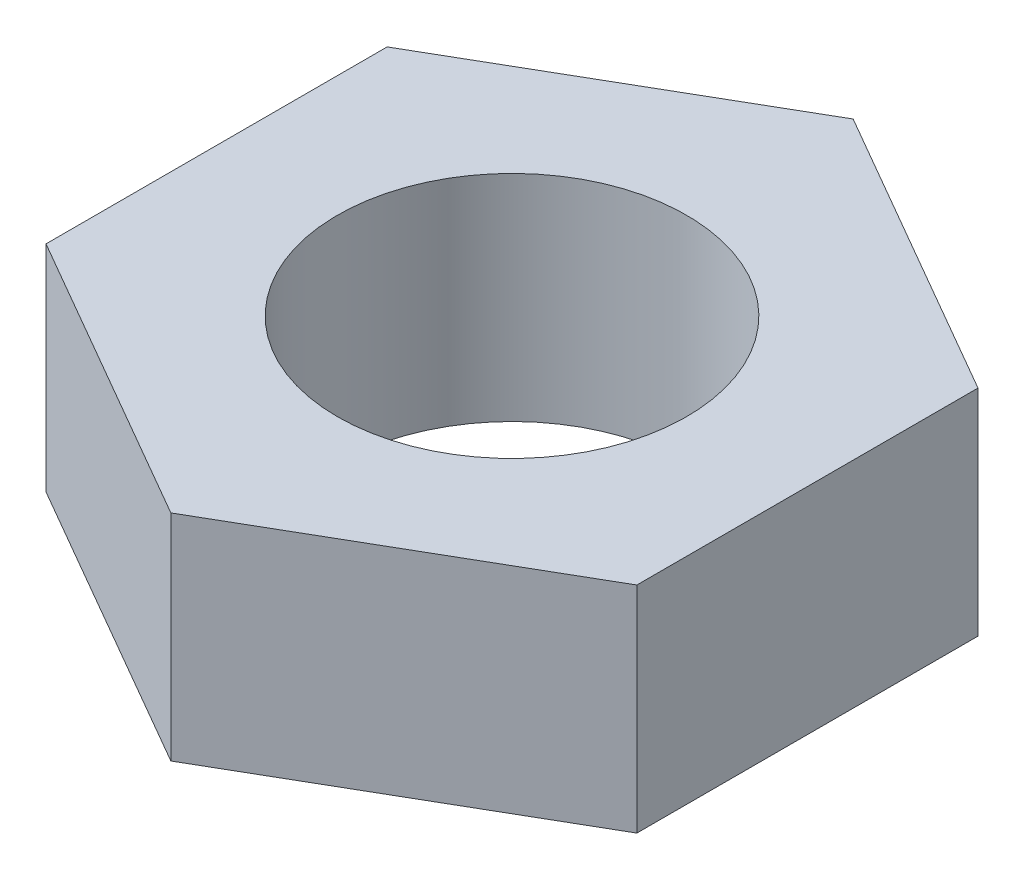
ISO-10303-21;
HEADER;
FILE_DESCRIPTION(('STEP AP214'),'2;1');
FILE_NAME('part.step','',(''),(''),'','','');
FILE_SCHEMA(('AUTOMOTIVE_DESIGN { 1 0 10303 214 1 1 1 1 }'));
ENDSEC;
DATA;
#1=APPLICATION_CONTEXT('core data for automotive mechanical design processes');
#2=APPLICATION_PROTOCOL_DEFINITION('international standard','automotive_design',2000,#1);
#3=PRODUCT_CONTEXT('',#1,'mechanical');
#4=PRODUCT('Part','Part','',(#3));
#5=PRODUCT_RELATED_PRODUCT_CATEGORY('part','',(#4));
#6=PRODUCT_DEFINITION_FORMATION('','',#4);
#7=PRODUCT_DEFINITION_CONTEXT('part definition',#1,'design');
#8=PRODUCT_DEFINITION('design','',#6,#7);
#9=PRODUCT_DEFINITION_SHAPE('','',#8);
#10=(LENGTH_UNIT() NAMED_UNIT(*) SI_UNIT(.MILLI.,.METRE.));
#11=(NAMED_UNIT(*) PLANE_ANGLE_UNIT() SI_UNIT($,.RADIAN.));
#12=(NAMED_UNIT(*) SI_UNIT($,.STERADIAN.) SOLID_ANGLE_UNIT());
#13=UNCERTAINTY_MEASURE_WITH_UNIT(LENGTH_MEASURE(1.E-05),#10,'distance_accuracy_value','');
#14=(GEOMETRIC_REPRESENTATION_CONTEXT(3) GLOBAL_UNCERTAINTY_ASSIGNED_CONTEXT((#13)) GLOBAL_UNIT_ASSIGNED_CONTEXT((#10,
#11,#12)) REPRESENTATION_CONTEXT('',''));
#15=CARTESIAN_POINT('',(0.,0.,0.));
#16=DIRECTION('',(0.,0.,1.));
#17=DIRECTION('',(1.,0.,0.));
#18=AXIS2_PLACEMENT_3D('',#15,#16,#17);
#19=CARTESIAN_POINT('',(0.,4.,0.));
#20=DIRECTION('',(0.,1.,0.));
#21=DIRECTION('',(0.,0.,1.));
#22=AXIS2_PLACEMENT_3D('',#19,#20,#21);
#23=PLANE('',#22);
#24=DIRECTION('',(0.,0.,-1.));
#25=VECTOR('',#24,1.);
#26=CARTESIAN_POINT('',(5.5,4.,3.17542648054294));
#27=LINE('',#26,#25);
#28=CARTESIAN_POINT('',(5.5,4.,3.17542648054294));
#29=VERTEX_POINT('',#28);
#30=CARTESIAN_POINT('',(5.5,4.,-3.17542648054294));
#31=VERTEX_POINT('',#30);
#32=EDGE_CURVE('E130',#29,#31,#27,.T.);
#33=ORIENTED_EDGE('',*,*,#32,.T.);
#34=DIRECTION('',(-0.866025403784439,0.,-0.5));
#35=VECTOR('',#34,1.);
#36=CARTESIAN_POINT('',(5.5,4.,-3.17542648054294));
#37=LINE('',#36,#35);
#38=CARTESIAN_POINT('',(0.,4.,-6.35085296108589));
#39=VERTEX_POINT('',#38);
#40=EDGE_CURVE('E88',#31,#39,#37,.T.);
#41=ORIENTED_EDGE('',*,*,#40,.T.);
#42=DIRECTION('',(-0.866025403784439,0.,0.5));
#43=VECTOR('',#42,1.);
#44=CARTESIAN_POINT('',(0.,4.,-6.35085296108589));
#45=LINE('',#44,#43);
#46=CARTESIAN_POINT('',(-5.5,4.,-3.17542648054294));
#47=VERTEX_POINT('',#46);
#48=EDGE_CURVE('E101',#39,#47,#45,.T.);
#49=ORIENTED_EDGE('',*,*,#48,.T.);
#50=DIRECTION('',(0.,0.,1.));
#51=VECTOR('',#50,1.);
#52=CARTESIAN_POINT('',(-5.5,4.,-3.17542648054294));
#53=LINE('',#52,#51);
#54=CARTESIAN_POINT('',(-5.5,4.,3.17542648054294));
#55=VERTEX_POINT('',#54);
#56=EDGE_CURVE('E95',#47,#55,#53,.T.);
#57=ORIENTED_EDGE('',*,*,#56,.T.);
#58=DIRECTION('',(0.866025403784438,0.,0.5));
#59=VECTOR('',#58,1.);
#60=CARTESIAN_POINT('',(-5.5,4.,3.17542648054294));
#61=LINE('',#60,#59);
#62=CARTESIAN_POINT('',(0.,4.,6.35085296108589));
#63=VERTEX_POINT('',#62);
#64=EDGE_CURVE('E99',#55,#63,#61,.T.);
#65=ORIENTED_EDGE('',*,*,#64,.T.);
#66=DIRECTION('',(0.866025403784438,0.,-0.5));
#67=VECTOR('',#66,1.);
#68=CARTESIAN_POINT('',(0.,4.,6.35085296108589));
#69=LINE('',#68,#67);
#70=EDGE_CURVE('E51',#63,#29,#69,.T.);
#71=ORIENTED_EDGE('',*,*,#70,.T.);
#72=EDGE_LOOP('',(#33,#41,#49,#57,#65,#71));
#73=FACE_BOUND('',#72,.T.);
#74=CARTESIAN_POINT('',(0.,4.,0.));
#75=DIRECTION('',(0.,1.,0.));
#76=DIRECTION('',(0.,0.,1.));
#77=AXIS2_PLACEMENT_3D('',#74,#75,#76);
#78=CIRCLE('',#77,3.25);
#79=CARTESIAN_POINT('',(0.,4.,3.25));
#80=VERTEX_POINT('',#79);
#81=EDGE_CURVE('E123',#80,#80,#78,.T.);
#82=ORIENTED_EDGE('',*,*,#81,.F.);
#83=EDGE_LOOP('',(#82));
#84=FACE_BOUND('',#83,.T.);
#85=ADVANCED_FACE('F34',(#73,#84),#23,.T.);
#86=CARTESIAN_POINT('',(0.,0.,0.));
#87=DIRECTION('',(0.,1.,0.));
#88=DIRECTION('',(0.,0.,1.));
#89=AXIS2_PLACEMENT_3D('',#86,#87,#88);
#90=PLANE('',#89);
#91=DIRECTION('',(0.,0.,-1.));
#92=VECTOR('',#91,1.);
#93=CARTESIAN_POINT('',(5.5,0.,3.17542648054294));
#94=LINE('',#93,#92);
#95=CARTESIAN_POINT('',(5.5,0.,3.17542648054294));
#96=VERTEX_POINT('',#95);
#97=CARTESIAN_POINT('',(5.5,0.,-3.17542648054294));
#98=VERTEX_POINT('',#97);
#99=EDGE_CURVE('E119',#96,#98,#94,.T.);
#100=ORIENTED_EDGE('',*,*,#99,.F.);
#101=DIRECTION('',(0.866025403784438,0.,-0.5));
#102=VECTOR('',#101,1.);
#103=CARTESIAN_POINT('',(0.,0.,6.35085296108589));
#104=LINE('',#103,#102);
#105=CARTESIAN_POINT('',(0.,0.,6.35085296108589));
#106=VERTEX_POINT('',#105);
#107=EDGE_CURVE('E80',#106,#96,#104,.T.);
#108=ORIENTED_EDGE('',*,*,#107,.F.);
#109=DIRECTION('',(0.866025403784438,0.,0.5));
#110=VECTOR('',#109,1.);
#111=CARTESIAN_POINT('',(-5.5,0.,3.17542648054294));
#112=LINE('',#111,#110);
#113=CARTESIAN_POINT('',(-5.5,0.,3.17542648054294));
#114=VERTEX_POINT('',#113);
#115=EDGE_CURVE('E74',#114,#106,#112,.T.);
#116=ORIENTED_EDGE('',*,*,#115,.F.);
#117=DIRECTION('',(0.,0.,1.));
#118=VECTOR('',#117,1.);
#119=CARTESIAN_POINT('',(-5.5,0.,-3.17542648054294));
#120=LINE('',#119,#118);
#121=CARTESIAN_POINT('',(-5.5,0.,-3.17542648054294));
#122=VERTEX_POINT('',#121);
#123=EDGE_CURVE('E109',#122,#114,#120,.T.);
#124=ORIENTED_EDGE('',*,*,#123,.F.);
#125=DIRECTION('',(-0.866025403784439,0.,0.5));
#126=VECTOR('',#125,1.);
#127=CARTESIAN_POINT('',(0.,0.,-6.35085296108589));
#128=LINE('',#127,#126);
#129=CARTESIAN_POINT('',(0.,0.,-6.35085296108589));
#130=VERTEX_POINT('',#129);
#131=EDGE_CURVE('E125',#130,#122,#128,.T.);
#132=ORIENTED_EDGE('',*,*,#131,.F.);
#133=DIRECTION('',(-0.866025403784439,0.,-0.5));
#134=VECTOR('',#133,1.);
#135=CARTESIAN_POINT('',(5.5,0.,-3.17542648054294));
#136=LINE('',#135,#134);
#137=EDGE_CURVE('E122',#98,#130,#136,.T.);
#138=ORIENTED_EDGE('',*,*,#137,.F.);
#139=EDGE_LOOP('',(#100,#108,#116,#124,#132,#138));
#140=FACE_BOUND('',#139,.T.);
#141=CARTESIAN_POINT('',(0.,0.,0.));
#142=DIRECTION('',(0.,1.,0.));
#143=DIRECTION('',(0.,0.,1.));
#144=AXIS2_PLACEMENT_3D('',#141,#142,#143);
#145=CIRCLE('',#144,3.25);
#146=CARTESIAN_POINT('',(0.,0.,3.25));
#147=VERTEX_POINT('',#146);
#148=EDGE_CURVE('E223',#147,#147,#145,.T.);
#149=ORIENTED_EDGE('',*,*,#148,.T.);
#150=EDGE_LOOP('',(#149));
#151=FACE_BOUND('',#150,.T.);
#152=ADVANCED_FACE('F139',(#140,#151),#90,.F.);
#153=CARTESIAN_POINT('',(5.5,4.,3.17542648054294));
#154=DIRECTION('',(-1.,0.,0.));
#155=DIRECTION('',(0.,0.,1.));
#156=AXIS2_PLACEMENT_3D('',#153,#154,#155);
#157=PLANE('',#156);
#158=ORIENTED_EDGE('',*,*,#99,.T.);
#159=DIRECTION('',(0.,-1.,0.));
#160=VECTOR('',#159,1.);
#161=CARTESIAN_POINT('',(5.5,4.,-3.17542648054294));
#162=LINE('',#161,#160);
#163=EDGE_CURVE('E11',#31,#98,#162,.T.);
#164=ORIENTED_EDGE('',*,*,#163,.F.);
#165=ORIENTED_EDGE('',*,*,#32,.F.);
#166=DIRECTION('',(0.,-1.,0.));
#167=VECTOR('',#166,1.);
#168=CARTESIAN_POINT('',(5.5,4.,3.17542648054294));
#169=LINE('',#168,#167);
#170=EDGE_CURVE('E115',#29,#96,#169,.T.);
#171=ORIENTED_EDGE('',*,*,#170,.T.);
#172=EDGE_LOOP('',(#158,#164,#165,#171));
#173=FACE_BOUND('',#172,.T.);
#174=ADVANCED_FACE('F36',(#173),#157,.F.);
#175=CARTESIAN_POINT('',(5.5,4.,-3.17542648054294));
#176=DIRECTION('',(-0.5,0.,0.866025403784439));
#177=DIRECTION('',(0.866025403784439,0.,0.5));
#178=AXIS2_PLACEMENT_3D('',#175,#176,#177);
#179=PLANE('',#178);
#180=ORIENTED_EDGE('',*,*,#137,.T.);
#181=DIRECTION('',(0.,-1.,0.));
#182=VECTOR('',#181,1.);
#183=CARTESIAN_POINT('',(0.,4.,-6.35085296108589));
#184=LINE('',#183,#182);
#185=EDGE_CURVE('E43',#39,#130,#184,.T.);
#186=ORIENTED_EDGE('',*,*,#185,.F.);
#187=ORIENTED_EDGE('',*,*,#40,.F.);
#188=ORIENTED_EDGE('',*,*,#163,.T.);
#189=EDGE_LOOP('',(#180,#186,#187,#188));
#190=FACE_BOUND('',#189,.T.);
#191=ADVANCED_FACE('F164',(#190),#179,.F.);
#192=CARTESIAN_POINT('',(0.,4.,-6.35085296108589));
#193=DIRECTION('',(0.5,0.,0.866025403784439));
#194=DIRECTION('',(0.866025403784439,0.,-0.5));
#195=AXIS2_PLACEMENT_3D('',#192,#193,#194);
#196=PLANE('',#195);
#197=ORIENTED_EDGE('',*,*,#131,.T.);
#198=DIRECTION('',(0.,-1.,0.));
#199=VECTOR('',#198,1.);
#200=CARTESIAN_POINT('',(-5.5,4.,-3.17542648054294));
#201=LINE('',#200,#199);
#202=EDGE_CURVE('E110',#47,#122,#201,.T.);
#203=ORIENTED_EDGE('',*,*,#202,.F.);
#204=ORIENTED_EDGE('',*,*,#48,.F.);
#205=ORIENTED_EDGE('',*,*,#185,.T.);
#206=EDGE_LOOP('',(#197,#203,#204,#205));
#207=FACE_BOUND('',#206,.T.);
#208=ADVANCED_FACE('F136',(#207),#196,.F.);
#209=CARTESIAN_POINT('',(-5.5,4.,-3.17542648054294));
#210=DIRECTION('',(1.,0.,0.));
#211=DIRECTION('',(0.,0.,-1.));
#212=AXIS2_PLACEMENT_3D('',#209,#210,#211);
#213=PLANE('',#212);
#214=ORIENTED_EDGE('',*,*,#123,.T.);
#215=DIRECTION('',(0.,-1.,0.));
#216=VECTOR('',#215,1.);
#217=CARTESIAN_POINT('',(-5.5,4.,3.17542648054294));
#218=LINE('',#217,#216);
#219=EDGE_CURVE('E106',#55,#114,#218,.T.);
#220=ORIENTED_EDGE('',*,*,#219,.F.);
#221=ORIENTED_EDGE('',*,*,#56,.F.);
#222=ORIENTED_EDGE('',*,*,#202,.T.);
#223=EDGE_LOOP('',(#214,#220,#221,#222));
#224=FACE_BOUND('',#223,.T.);
#225=ADVANCED_FACE('F107',(#224),#213,.F.);
#226=CARTESIAN_POINT('',(-5.5,4.,3.17542648054294));
#227=DIRECTION('',(0.5,0.,-0.866025403784439));
#228=DIRECTION('',(-0.866025403784438,0.,-0.5));
#229=AXIS2_PLACEMENT_3D('',#226,#227,#228);
#230=PLANE('',#229);
#231=ORIENTED_EDGE('',*,*,#115,.T.);
#232=DIRECTION('',(0.,-1.,0.));
#233=VECTOR('',#232,1.);
#234=CARTESIAN_POINT('',(0.,4.,6.35085296108589));
#235=LINE('',#234,#233);
#236=EDGE_CURVE('E111',#63,#106,#235,.T.);
#237=ORIENTED_EDGE('',*,*,#236,.F.);
#238=ORIENTED_EDGE('',*,*,#64,.F.);
#239=ORIENTED_EDGE('',*,*,#219,.T.);
#240=EDGE_LOOP('',(#231,#237,#238,#239));
#241=FACE_BOUND('',#240,.T.);
#242=ADVANCED_FACE('F113',(#241),#230,.F.);
#243=CARTESIAN_POINT('',(0.,4.,6.35085296108589));
#244=DIRECTION('',(-0.5,0.,-0.866025403784438));
#245=DIRECTION('',(-0.866025403784438,0.,0.5));
#246=AXIS2_PLACEMENT_3D('',#243,#244,#245);
#247=PLANE('',#246);
#248=ORIENTED_EDGE('',*,*,#107,.T.);
#249=ORIENTED_EDGE('',*,*,#170,.F.);
#250=ORIENTED_EDGE('',*,*,#70,.F.);
#251=ORIENTED_EDGE('',*,*,#236,.T.);
#252=EDGE_LOOP('',(#248,#249,#250,#251));
#253=FACE_BOUND('',#252,.T.);
#254=ADVANCED_FACE('F144',(#253),#247,.F.);
#255=CARTESIAN_POINT('',(0.,4.,0.));
#256=DIRECTION('',(0.,-1.,0.));
#257=DIRECTION('',(0.,0.,-1.));
#258=AXIS2_PLACEMENT_3D('',#255,#256,#257);
#259=CYLINDRICAL_SURFACE('',#258,3.25);
#260=ORIENTED_EDGE('',*,*,#81,.T.);
#261=EDGE_LOOP('',(#260));
#262=FACE_BOUND('',#261,.T.);
#263=ORIENTED_EDGE('',*,*,#148,.F.);
#264=EDGE_LOOP('',(#263));
#265=FACE_BOUND('',#264,.T.);
#266=ADVANCED_FACE('F146',(#262,#265),#259,.F.);
#267=CLOSED_SHELL('',(#85,#152,#174,#191,#208,#225,#242,#254,#266));
#268=MANIFOLD_SOLID_BREP('B2',#267);
#269=ADVANCED_BREP_SHAPE_REPRESENTATION('',(#18,#268),#14);
#270=SHAPE_DEFINITION_REPRESENTATION(#9,#269);
ENDSEC;
END-ISO-10303-21;
